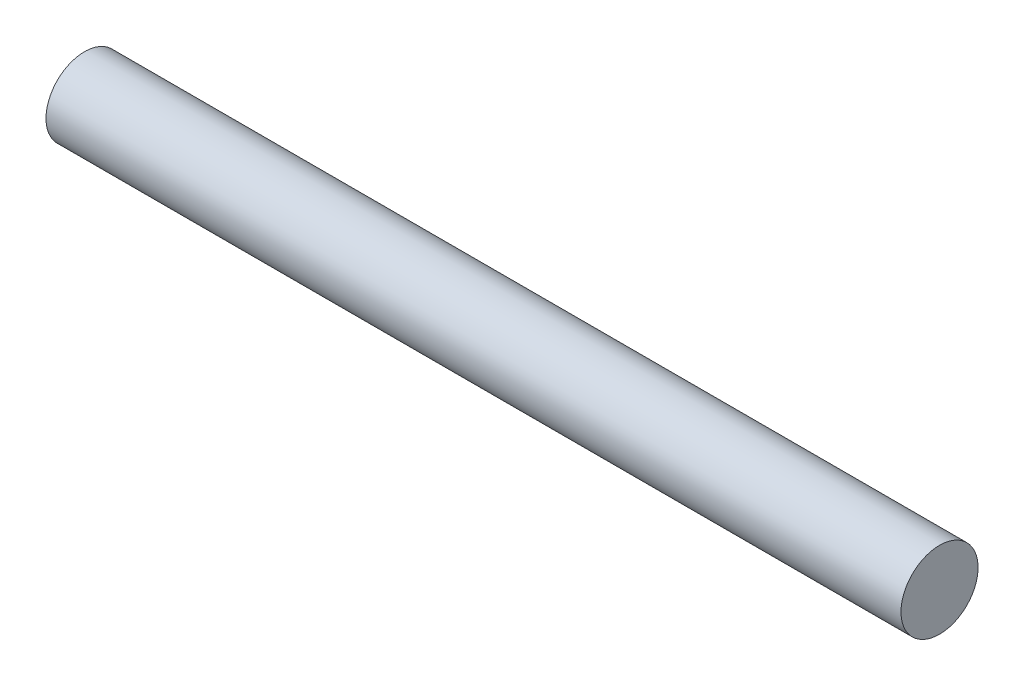
ISO-10303-21;
HEADER;
FILE_DESCRIPTION(('STEP AP214'),'2;1');
FILE_NAME('part.step','',(''),(''),'','','');
FILE_SCHEMA(('AUTOMOTIVE_DESIGN { 1 0 10303 214 1 1 1 1 }'));
ENDSEC;
DATA;
#1=APPLICATION_CONTEXT('core data for automotive mechanical design processes');
#2=APPLICATION_PROTOCOL_DEFINITION('international standard','automotive_design',2000,#1);
#3=PRODUCT_CONTEXT('',#1,'mechanical');
#4=PRODUCT('Part','Part','',(#3));
#5=PRODUCT_RELATED_PRODUCT_CATEGORY('part','',(#4));
#6=PRODUCT_DEFINITION_FORMATION('','',#4);
#7=PRODUCT_DEFINITION_CONTEXT('part definition',#1,'design');
#8=PRODUCT_DEFINITION('design','',#6,#7);
#9=PRODUCT_DEFINITION_SHAPE('','',#8);
#10=(LENGTH_UNIT() NAMED_UNIT(*) SI_UNIT(.MILLI.,.METRE.));
#11=(NAMED_UNIT(*) PLANE_ANGLE_UNIT() SI_UNIT($,.RADIAN.));
#12=(NAMED_UNIT(*) SI_UNIT($,.STERADIAN.) SOLID_ANGLE_UNIT());
#13=UNCERTAINTY_MEASURE_WITH_UNIT(LENGTH_MEASURE(1.E-05),#10,'distance_accuracy_value','');
#14=(GEOMETRIC_REPRESENTATION_CONTEXT(3) GLOBAL_UNCERTAINTY_ASSIGNED_CONTEXT((#13)) GLOBAL_UNIT_ASSIGNED_CONTEXT((#10,
#11,#12)) REPRESENTATION_CONTEXT('',''));
#15=CARTESIAN_POINT('',(0.,0.,0.));
#16=DIRECTION('',(0.,0.,1.));
#17=DIRECTION('',(1.,0.,0.));
#18=AXIS2_PLACEMENT_3D('',#15,#16,#17);
#19=CARTESIAN_POINT('',(-28.2482989960204,0.,0.));
#20=DIRECTION('',(-1.,0.,0.));
#21=DIRECTION('',(0.,0.,1.));
#22=AXIS2_PLACEMENT_3D('',#19,#20,#21);
#23=CYLINDRICAL_SURFACE('',#22,2.415);
#24=CARTESIAN_POINT('',(-28.2482989960204,0.,0.));
#25=DIRECTION('',(-1.,0.,0.));
#26=DIRECTION('',(0.,0.,1.));
#27=AXIS2_PLACEMENT_3D('',#24,#25,#26);
#28=CIRCLE('',#27,2.415);
#29=CARTESIAN_POINT('',(-28.2482989960204,0.,2.415));
#30=VERTEX_POINT('',#29);
#31=EDGE_CURVE('E10',#30,#30,#28,.T.);
#32=ORIENTED_EDGE('',*,*,#31,.F.);
#33=EDGE_LOOP('',(#32));
#34=FACE_BOUND('',#33,.T.);
#35=CARTESIAN_POINT('',(25.3267010039797,0.,0.));
#36=DIRECTION('',(-1.,0.,0.));
#37=DIRECTION('',(0.,0.,1.));
#38=AXIS2_PLACEMENT_3D('',#35,#36,#37);
#39=CIRCLE('',#38,2.41500000000001);
#40=CARTESIAN_POINT('',(25.3267010039797,0.,2.41500000000001));
#41=VERTEX_POINT('',#40);
#42=EDGE_CURVE('E38',#41,#41,#39,.T.);
#43=ORIENTED_EDGE('',*,*,#42,.T.);
#44=EDGE_LOOP('',(#43));
#45=FACE_BOUND('',#44,.T.);
#46=ADVANCED_FACE('F32',(#34,#45),#23,.T.);
#47=CARTESIAN_POINT('',(-28.2482989960204,2.415,0.));
#48=DIRECTION('',(1.,0.,0.));
#49=DIRECTION('',(0.,0.,-1.));
#50=AXIS2_PLACEMENT_3D('',#47,#48,#49);
#51=PLANE('',#50);
#52=ORIENTED_EDGE('',*,*,#31,.T.);
#53=EDGE_LOOP('',(#52));
#54=FACE_BOUND('',#53,.T.);
#55=ADVANCED_FACE('F47',(#54),#51,.F.);
#56=CARTESIAN_POINT('',(25.3267010039797,0.,0.));
#57=DIRECTION('',(-1.,0.,0.));
#58=DIRECTION('',(0.,0.,1.));
#59=AXIS2_PLACEMENT_3D('',#56,#57,#58);
#60=PLANE('',#59);
#61=ORIENTED_EDGE('',*,*,#42,.F.);
#62=EDGE_LOOP('',(#61));
#63=FACE_BOUND('',#62,.T.);
#64=ADVANCED_FACE('F45',(#63),#60,.F.);
#65=CLOSED_SHELL('',(#46,#55,#64));
#66=MANIFOLD_SOLID_BREP('B2',#65);
#67=ADVANCED_BREP_SHAPE_REPRESENTATION('',(#18,#66),#14);
#68=SHAPE_DEFINITION_REPRESENTATION(#9,#67);
ENDSEC;
END-ISO-10303-21;
